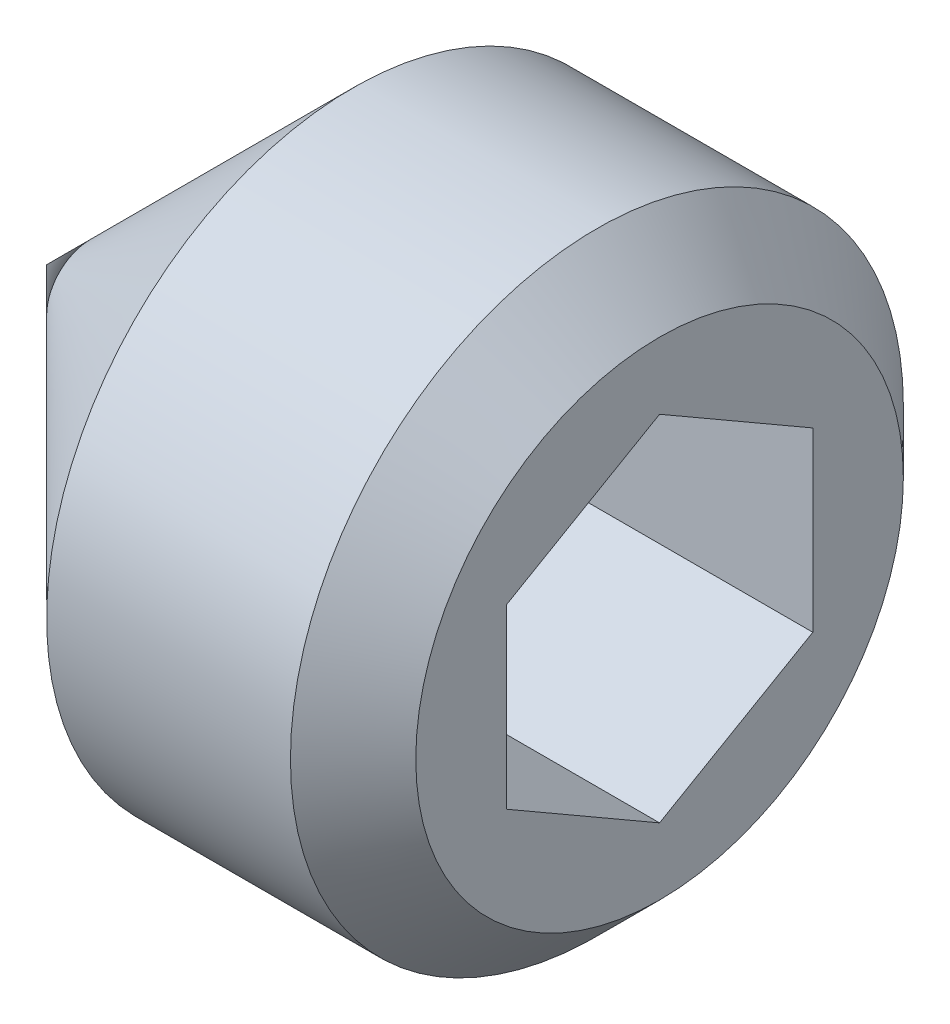
ISO-10303-21;
HEADER;
FILE_DESCRIPTION(('STEP AP214'),'2;1');
FILE_NAME('part.step','',(''),(''),'','','');
FILE_SCHEMA(('AUTOMOTIVE_DESIGN { 1 0 10303 214 1 1 1 1 }'));
ENDSEC;
DATA;
#1=APPLICATION_CONTEXT('core data for automotive mechanical design processes');
#2=APPLICATION_PROTOCOL_DEFINITION('international standard','automotive_design',2000,#1);
#3=PRODUCT_CONTEXT('',#1,'mechanical');
#4=PRODUCT('Part','Part','',(#3));
#5=PRODUCT_RELATED_PRODUCT_CATEGORY('part','',(#4));
#6=PRODUCT_DEFINITION_FORMATION('','',#4);
#7=PRODUCT_DEFINITION_CONTEXT('part definition',#1,'design');
#8=PRODUCT_DEFINITION('design','',#6,#7);
#9=PRODUCT_DEFINITION_SHAPE('','',#8);
#10=(LENGTH_UNIT() NAMED_UNIT(*) SI_UNIT(.MILLI.,.METRE.));
#11=(NAMED_UNIT(*) PLANE_ANGLE_UNIT() SI_UNIT($,.RADIAN.));
#12=(NAMED_UNIT(*) SI_UNIT($,.STERADIAN.) SOLID_ANGLE_UNIT());
#13=UNCERTAINTY_MEASURE_WITH_UNIT(LENGTH_MEASURE(1.E-05),#10,'distance_accuracy_value','');
#14=(GEOMETRIC_REPRESENTATION_CONTEXT(3) GLOBAL_UNCERTAINTY_ASSIGNED_CONTEXT((#13)) GLOBAL_UNIT_ASSIGNED_CONTEXT((#10,
#11,#12)) REPRESENTATION_CONTEXT('',''));
#15=CARTESIAN_POINT('',(0.,0.,0.));
#16=DIRECTION('',(0.,0.,1.));
#17=DIRECTION('',(1.,0.,0.));
#18=AXIS2_PLACEMENT_3D('',#15,#16,#17);
#19=CARTESIAN_POINT('',(3.,-0.433012701892213,-0.749999999999996));
#20=DIRECTION('',(0.,0.,-1.));
#21=DIRECTION('',(0.,1.,0.));
#22=AXIS2_PLACEMENT_3D('',#19,#20,#21);
#23=PLANE('',#22);
#24=DIRECTION('',(1.,0.,0.));
#25=VECTOR('',#24,1.);
#26=CARTESIAN_POINT('',(3.,-0.433012701892213,-0.749999999999996));
#27=LINE('',#26,#25);
#28=CARTESIAN_POINT('',(0.999999999962121,-0.433012701894947,-0.750000000004731));
#29=VERTEX_POINT('',#28);
#30=CARTESIAN_POINT('',(3.,-0.433012701892213,-0.749999999999996));
#31=VERTEX_POINT('',#30);
#32=EDGE_CURVE('E78',#29,#31,#27,.T.);
#33=ORIENTED_EDGE('',*,*,#32,.T.);
#34=DIRECTION('',(0.,1.,0.));
#35=VECTOR('',#34,1.);
#36=CARTESIAN_POINT('',(3.,-0.433012701892213,-0.749999999999996));
#37=LINE('',#36,#35);
#38=CARTESIAN_POINT('',(3.,0.433012701892219,-0.749999999999994));
#39=VERTEX_POINT('',#38);
#40=EDGE_CURVE('E84',#39,#31,#37,.F.);
#41=ORIENTED_EDGE('',*,*,#40,.F.);
#42=DIRECTION('',(1.,0.,0.));
#43=VECTOR('',#42,1.);
#44=CARTESIAN_POINT('',(3.,0.433012701892219,-0.749999999999994));
#45=LINE('',#44,#43);
#46=CARTESIAN_POINT('',(0.999999999960543,0.433012701897685,-0.749999999999994));
#47=VERTEX_POINT('',#46);
#48=EDGE_CURVE('E81',#39,#47,#45,.F.);
#49=ORIENTED_EDGE('',*,*,#48,.T.);
#50=CARTESIAN_POINT('',(0.999999999962121,-0.433012701903148,-0.749999999999996));
#51=CARTESIAN_POINT('',(0.989010828242881,-0.39495613049456,-0.749999999999996));
#52=CARTESIAN_POINT('',(0.979016752629088,-0.356571055078982,-0.749999999999996));
#53=CARTESIAN_POINT('',(0.961572394458081,-0.279136292191111,-0.749999999999996));
#54=CARTESIAN_POINT('',(0.954128282381848,-0.24008522930043,-0.749999999999996));
#55=CARTESIAN_POINT('',(0.942540984766453,-0.162467043921834,-0.749999999999995));
#56=CARTESIAN_POINT('',(0.938320670362053,-0.123911860637817,-0.749999999999995));
#57=CARTESIAN_POINT('',(0.933283437953925,-0.0466201738043249,-0.749999999999995));
#58=CARTESIAN_POINT('',(0.932462347685355,-0.0078839509963972,-0.749999999999995));
#59=CARTESIAN_POINT('',(0.934174858777906,0.0644905257899308,-0.749999999999995));
#60=CARTESIAN_POINT('',(0.936287981917351,0.0981396401494632,-0.749999999999995));
#61=CARTESIAN_POINT('',(0.942983987724431,0.16521865586672,-0.749999999999994));
#62=CARTESIAN_POINT('',(0.947569155495857,0.198648325389211,-0.749999999999994));
#63=CARTESIAN_POINT('',(0.959031187462022,0.265865530206527,-0.749999999999994));
#64=CARTESIAN_POINT('',(0.965956615792015,0.299644562548561,-0.749999999999994));
#65=CARTESIAN_POINT('',(0.981674410275084,0.366698958680412,-0.749999999999994));
#66=CARTESIAN_POINT('',(0.990463085742577,0.399975180851877,-0.749999999999994));
#67=CARTESIAN_POINT('',(0.999999999962121,0.433012701903152,-0.749999999999994));
#68=B_SPLINE_CURVE_WITH_KNOTS('',3,(#50,#51,#52,#53,#54,#55,#56,#57,#58,#59,#60,#61,#62,#63,#64,
#65,#66,#67),.UNSPECIFIED.,.F.,.F.,(4,2,2,2,2,2,2,2,4),(0.,0.118881004366687,0.238047681455816,
0.354265352378773,0.470340333408877,0.571390418563902,0.672534072754611,0.77592060852001,
0.879104240159883),.UNSPECIFIED.);
#69=EDGE_CURVE('E21',#29,#47,#68,.T.);
#70=ORIENTED_EDGE('',*,*,#69,.F.);
#71=EDGE_LOOP('',(#33,#41,#49,#70));
#72=FACE_BOUND('',#71,.T.);
#73=ADVANCED_FACE('F17',(#72),#23,.F.);
#74=CARTESIAN_POINT('',(3.,-0.866025403784432,0.));
#75=DIRECTION('',(0.,-0.866025403784437,-0.500000000000003));
#76=DIRECTION('',(0.,0.500000000000003,-0.866025403784437));
#77=AXIS2_PLACEMENT_3D('',#74,#75,#76);
#78=PLANE('',#77);
#79=DIRECTION('',(1.,0.,0.));
#80=VECTOR('',#79,1.);
#81=CARTESIAN_POINT('',(3.,-0.866025403784432,0.));
#82=LINE('',#81,#80);
#83=CARTESIAN_POINT('',(0.999999999960689,-0.86602540378742,5.17137737454117E-12));
#84=VERTEX_POINT('',#83);
#85=CARTESIAN_POINT('',(3.,-0.866025403784432,0.));
#86=VERTEX_POINT('',#85);
#87=EDGE_CURVE('E152',#84,#86,#82,.T.);
#88=ORIENTED_EDGE('',*,*,#87,.T.);
#89=DIRECTION('',(0.,0.500000000000003,-0.866025403784437));
#90=VECTOR('',#89,1.);
#91=CARTESIAN_POINT('',(3.,-0.866025403784432,0.));
#92=LINE('',#91,#90);
#93=EDGE_CURVE('E94',#31,#86,#92,.F.);
#94=ORIENTED_EDGE('',*,*,#93,.F.);
#95=ORIENTED_EDGE('',*,*,#32,.F.);
#96=CARTESIAN_POINT('',(0.999999999962414,-0.866025403790407,1.03461158247932E-11));
#97=CARTESIAN_POINT('',(0.98901082824315,-0.846997118086104,-0.0329579576104424));
#98=CARTESIAN_POINT('',(0.979016752629332,-0.827804580378307,-0.066200408046529));
#99=CARTESIAN_POINT('',(0.961572394458272,-0.789087198934353,-0.13326087984348));
#100=CARTESIAN_POINT('',(0.954128282382011,-0.769561667489004,-0.167080092351609));
#101=CARTESIAN_POINT('',(0.942540984766562,-0.730752574799687,-0.234299412685156));
#102=CARTESIAN_POINT('',(0.938320670362134,-0.711474983157669,-0.267689180856696));
#103=CARTESIAN_POINT('',(0.933283437953954,-0.672829139740903,-0.334625745155884));
#104=CARTESIAN_POINT('',(0.932462347685359,-0.653461028336929,-0.368172298154222));
#105=CARTESIAN_POINT('',(0.934174858777868,-0.617273789943722,-0.430850433636863));
#106=CARTESIAN_POINT('',(0.936287981917299,-0.600449232763923,-0.459991421487123));
#107=CARTESIAN_POINT('',(0.942983987724363,-0.566909724905229,-0.518083553159236));
#108=CARTESIAN_POINT('',(0.947569155495786,-0.55019489014395,-0.547034496205888));
#109=CARTESIAN_POINT('',(0.959031187461956,-0.516586287735225,-0.605246303149181));
#110=CARTESIAN_POINT('',(0.965956615791957,-0.499696771564174,-0.634499803272697));
#111=CARTESIAN_POINT('',(0.981674410275049,-0.466169573498182,-0.692570613758421));
#112=CARTESIAN_POINT('',(0.990463085742558,-0.449531462412416,-0.721388667500942));
#113=CARTESIAN_POINT('',(0.999999999962121,-0.433012701886746,-0.750000000009465));
#114=B_SPLINE_CURVE_WITH_KNOTS('',3,(#96,#97,#98,#99,#100,#101,#102,#103,#104,#105,#106,#107,
#108,#109,#110,#111,#112,#113),.UNSPECIFIED.,.F.,.F.,(4,2,2,2,2,2,2,2,4),(0.,0.118881004366756,
0.238047681455955,0.354265352378976,0.470340333409143,0.57139041856436,0.672534072755263,
0.775920608520866,0.87910424016094),.UNSPECIFIED.);
#115=EDGE_CURVE('E86',#84,#29,#114,.T.);
#116=ORIENTED_EDGE('',*,*,#115,.F.);
#117=EDGE_LOOP('',(#88,#94,#95,#116));
#118=FACE_BOUND('',#117,.T.);
#119=ADVANCED_FACE('F95',(#118),#78,.F.);
#120=CARTESIAN_POINT('',(3.,0.433012701892219,-0.749999999999994));
#121=DIRECTION('',(0.,0.86602540378444,-0.499999999999998));
#122=DIRECTION('',(0.,0.499999999999998,0.86602540378444));
#123=AXIS2_PLACEMENT_3D('',#120,#121,#122);
#124=PLANE('',#123);
#125=ORIENTED_EDGE('',*,*,#48,.F.);
#126=DIRECTION('',(0.,0.499999999999998,0.86602540378444));
#127=VECTOR('',#126,1.);
#128=CARTESIAN_POINT('',(3.,0.433012701892219,-0.749999999999994));
#129=LINE('',#128,#127);
#130=CARTESIAN_POINT('',(3.,0.866025403784434,0.));
#131=VERTEX_POINT('',#130);
#132=EDGE_CURVE('E93',#131,#39,#129,.F.);
#133=ORIENTED_EDGE('',*,*,#132,.F.);
#134=DIRECTION('',(1.,0.,0.));
#135=VECTOR('',#134,1.);
#136=CARTESIAN_POINT('',(3.,0.866025403784435,0.));
#137=LINE('',#136,#135);
#138=CARTESIAN_POINT('',(1.00000000476924,0.866025412116072,1.44308221374837E-08));
#139=VERTEX_POINT('',#138);
#140=EDGE_CURVE('E197',#131,#139,#137,.F.);
#141=ORIENTED_EDGE('',*,*,#140,.T.);
#142=CARTESIAN_POINT('',(0.999999999962122,0.433012701886752,-0.750000000009464));
#143=CARTESIAN_POINT('',(0.989010828239795,0.452040987596458,-0.717042042379314));
#144=CARTESIAN_POINT('',(0.979016752623435,0.471233525309727,-0.683799591933751));
#145=CARTESIAN_POINT('',(0.961572394448595,0.50995090676548,-0.616739120116361));
#146=CARTESIAN_POINT('',(0.954128282371191,0.529476438217169,-0.582919907597253));
#147=CARTESIAN_POINT('',(0.942540984759421,0.568285530907423,-0.515700587262082));
#148=CARTESIAN_POINT('',(0.938320670357912,0.587563122543893,-0.482310819100152));
#149=CARTESIAN_POINT('',(0.933283437953257,0.626208965948556,-0.415374254821923));
#150=CARTESIAN_POINT('',(0.93246234768518,0.645577077345975,-0.38182770183494));
#151=CARTESIAN_POINT('',(0.934174858844876,0.681764317140096,-0.319149563925843));
#152=CARTESIAN_POINT('',(0.936287982271723,0.698588875724347,-0.290008573643002));
#153=CARTESIAN_POINT('',(0.942983989049004,0.732128386368607,-0.231916437146147));
#154=CARTESIAN_POINT('',(0.947569157504165,0.748843222510944,-0.20296549170743));
#155=CARTESIAN_POINT('',(0.959031191175185,0.782451827713753,-0.14475367992464));
#156=CARTESIAN_POINT('',(0.965956620538646,0.799341345296458,-0.115500177356067));
#157=CARTESIAN_POINT('',(0.981674417313412,0.832868546134397,-0.0574293620691909));
#158=CARTESIAN_POINT('',(0.990463094037767,0.84950665858064,-0.0286113059702538));
#159=CARTESIAN_POINT('',(1.00000000957951,0.86602542044771,2.8861642659226E-08));
#160=B_SPLINE_CURVE_WITH_KNOTS('',3,(#142,#143,#144,#145,#146,#147,#148,#149,#150,#151,#152,
#153,#154,#155,#156,#157,#158,#159),.UNSPECIFIED.,.F.,.F.,(4,2,2,2,2,2,2,2,4),(0.,
0.118881004400395,0.23804768152756,0.354265352416226,0.470340333408895,0.571390427002778,
0.672534089663568,0.775920634338892,0.87910427482085),.UNSPECIFIED.);
#161=EDGE_CURVE('E147',#47,#139,#160,.T.);
#162=ORIENTED_EDGE('',*,*,#161,.F.);
#163=EDGE_LOOP('',(#125,#133,#141,#162));
#164=FACE_BOUND('',#163,.T.);
#165=ADVANCED_FACE('F153',(#164),#124,.F.);
#166=CARTESIAN_POINT('',(3.,-0.433012701892217,0.749999999999994));
#167=DIRECTION('',(0.,-0.86602540378444,0.499999999999998));
#168=DIRECTION('',(0.,-0.499999999999998,-0.86602540378444));
#169=AXIS2_PLACEMENT_3D('',#166,#167,#168);
#170=PLANE('',#169);
#171=DIRECTION('',(1.,0.,0.));
#172=VECTOR('',#171,1.);
#173=CARTESIAN_POINT('',(3.,-0.433012701892217,0.749999999999994));
#174=LINE('',#173,#172);
#175=CARTESIAN_POINT('',(0.999999992273757,-0.433012740197771,0.749999962513854));
#176=VERTEX_POINT('',#175);
#177=CARTESIAN_POINT('',(3.,-0.433012701892217,0.749999999999995));
#178=VERTEX_POINT('',#177);
#179=EDGE_CURVE('E227',#176,#178,#174,.T.);
#180=ORIENTED_EDGE('',*,*,#179,.T.);
#181=DIRECTION('',(0.,-0.499999999999998,-0.86602540378444));
#182=VECTOR('',#181,1.);
#183=CARTESIAN_POINT('',(3.,-0.433012701892217,0.749999999999994));
#184=LINE('',#183,#182);
#185=EDGE_CURVE('E198',#86,#178,#184,.F.);
#186=ORIENTED_EDGE('',*,*,#185,.F.);
#187=ORIENTED_EDGE('',*,*,#87,.F.);
#188=CARTESIAN_POINT('',(0.999999999966565,-0.86602540378386,-1.27486163788E-11));
#189=CARTESIAN_POINT('',(0.989010828252531,-0.84699711809759,0.0329579575856099));
#190=CARTESIAN_POINT('',(0.979016752644196,-0.827804580405544,0.0662004079980264));
#191=CARTESIAN_POINT('',(0.961572394482182,-0.789087198993177,0.133260879742916));
#192=CARTESIAN_POINT('',(0.954128282409237,-0.769561667563686,0.167080092222603));
#193=CARTESIAN_POINT('',(0.94254098478461,-0.730752574876204,0.23429941255228));
#194=CARTESIAN_POINT('',(0.938320670372638,-0.711474983219766,0.267689180749048));
#195=CARTESIAN_POINT('',(0.933283437955526,-0.672829139771393,0.334625745103164));
#196=CARTESIAN_POINT('',(0.932462347685778,-0.653461028350226,0.368172298131213));
#197=CARTESIAN_POINT('',(0.934174858604027,-0.617273793597875,0.430850427307664));
#198=CARTESIAN_POINT('',(0.936287980996616,-0.600449240068274,0.45999140883561));
#199=CARTESIAN_POINT('',(0.942983984282372,-0.566909739449323,0.518083527968133));
#200=CARTESIAN_POINT('',(0.947569150276894,-0.550194908277445,0.547034464797758));
#201=CARTESIAN_POINT('',(0.959031177812411,-0.516586313130587,0.605246259163125));
#202=CARTESIAN_POINT('',(0.965956603456569,-0.499696800628438,0.634499752931918));
#203=CARTESIAN_POINT('',(0.981674391983821,-0.466169609766752,0.692570550939419));
#204=CARTESIAN_POINT('',(0.990463064184889,-0.449531502216874,0.721388598557605));
#205=CARTESIAN_POINT('',(0.999999974968193,-0.433012745177506,0.749999925027674));
#206=B_SPLINE_CURVE_WITH_KNOTS('',3,(#188,#189,#190,#191,#192,#193,#194,#195,#196,#197,#198,
#199,#200,#201,#202,#203,#204,#205),.UNSPECIFIED.,.F.,.F.,(4,2,2,2,2,2,2,2,4),(0.,
0.118881004280357,0.238047681271773,0.354265352284752,0.470340333413098,0.571390396636129,
0.67253402881367,0.775920541422912,0.879104150082983),.UNSPECIFIED.);
#207=EDGE_CURVE('E89',#84,#176,#206,.T.);
#208=ORIENTED_EDGE('',*,*,#207,.T.);
#209=EDGE_LOOP('',(#180,#186,#187,#208));
#210=FACE_BOUND('',#209,.T.);
#211=ADVANCED_FACE('F156',(#210),#170,.F.);
#212=CARTESIAN_POINT('',(3.,0.866025403784434,0.));
#213=DIRECTION('',(0.,0.866025403784438,0.500000000000002));
#214=DIRECTION('',(0.,-0.500000000000002,0.866025403784438));
#215=AXIS2_PLACEMENT_3D('',#212,#213,#214);
#216=PLANE('',#215);
#217=ORIENTED_EDGE('',*,*,#140,.F.);
#218=DIRECTION('',(0.,-0.500000000000002,0.866025403784438));
#219=VECTOR('',#218,1.);
#220=CARTESIAN_POINT('',(3.,0.866025403784434,0.));
#221=LINE('',#220,#219);
#222=CARTESIAN_POINT('',(3.,0.433012701892216,0.749999999999996));
#223=VERTEX_POINT('',#222);
#224=EDGE_CURVE('E188',#223,#131,#221,.F.);
#225=ORIENTED_EDGE('',*,*,#224,.F.);
#226=DIRECTION('',(1.,0.,0.));
#227=VECTOR('',#226,1.);
#228=CARTESIAN_POINT('',(3.,0.433012701892216,0.749999999999996));
#229=LINE('',#228,#227);
#230=CARTESIAN_POINT('',(0.999999987456827,0.433012723546556,0.749999962493579));
#231=VERTEX_POINT('',#230);
#232=EDGE_CURVE('E119',#223,#231,#229,.F.);
#233=ORIENTED_EDGE('',*,*,#232,.T.);
#234=CARTESIAN_POINT('',(0.999999974954689,0.433012745200896,0.749999924987162));
#235=CARTESIAN_POINT('',(0.989010805289448,0.452041030174259,0.717041968632398));
#236=CARTESIAN_POINT('',(0.979016731857365,0.471233567146418,0.683799519470476));
#237=CARTESIAN_POINT('',(0.961572378214463,0.509950947046766,0.616739050347126));
#238=CARTESIAN_POINT('',(0.954128268481779,0.529476477683681,0.582919839239246));
#239=CARTESIAN_POINT('',(0.942540975499378,0.568285568788077,0.515700521650865));
#240=CARTESIAN_POINT('',(0.938320663398557,0.587563159656827,0.482310754818663));
#241=CARTESIAN_POINT('',(0.933283435442763,0.626209001437502,0.415374193353267));
#242=CARTESIAN_POINT('',(0.932462347324832,0.645577111978832,0.381827641849072));
#243=CARTESIAN_POINT('',(0.934174861815945,0.681764343053098,0.319149519043209));
#244=CARTESIAN_POINT('',(0.936287985371578,0.698588893799179,0.290008542336477));
#245=CARTESIAN_POINT('',(0.942983990052212,0.732128388842047,0.231916432862024));
#246=CARTESIAN_POINT('',(0.947569156276532,0.748843217221423,0.202965500869151));
#247=CARTESIAN_POINT('',(0.959031183412921,0.782451806683928,0.144753716349369));
#248=CARTESIAN_POINT('',(0.965956608398113,0.799341316296327,0.115500227585771));
#249=CARTESIAN_POINT('',(0.981674394920445,0.832868501467518,0.0574294394344978));
#250=CARTESIAN_POINT('',(0.990463065778315,0.849506606216351,0.0286113966678668));
#251=CARTESIAN_POINT('',(0.999999974967999,0.866025360498807,7.49729072637118E-08));
#252=B_SPLINE_CURVE_WITH_KNOTS('',3,(#234,#235,#236,#237,#238,#239,#240,#241,#242,#243,#244,
#245,#246,#247,#248,#249,#250,#251),.UNSPECIFIED.,.F.,.F.,(4,2,2,2,2,2,2,2,4),(0.,
0.118880998435461,0.238047669430943,0.354265334989351,0.470340310719626,0.5713903575498,
0.672533973271227,0.775920468532192,0.879104059954767),.UNSPECIFIED.);
#253=EDGE_CURVE('E143',#231,#139,#252,.T.);
#254=ORIENTED_EDGE('',*,*,#253,.T.);
#255=EDGE_LOOP('',(#217,#225,#233,#254));
#256=FACE_BOUND('',#255,.T.);
#257=ADVANCED_FACE('F131',(#256),#216,.F.);
#258=CARTESIAN_POINT('',(1.00299999996878,0.,0.));
#259=DIRECTION('',(1.,0.,0.));
#260=DIRECTION('',(0.,0.,-1.));
#261=AXIS2_PLACEMENT_3D('',#258,#259,#260);
#262=CONICAL_SURFACE('',#261,0.8712215562241,1.04719755119347);
#263=CARTESIAN_POINT('',(0.499999999988177,-5.6843418860808E-11,0.));
#264=VERTEX_POINT('',#263);
#265=VERTEX_LOOP('',#264);
#266=FACE_BOUND('',#265,.T.);
#267=ORIENTED_EDGE('',*,*,#207,.F.);
#268=ORIENTED_EDGE('',*,*,#115,.T.);
#269=ORIENTED_EDGE('',*,*,#69,.T.);
#270=ORIENTED_EDGE('',*,*,#161,.T.);
#271=ORIENTED_EDGE('',*,*,#253,.F.);
#272=CARTESIAN_POINT('',(1.00000000957721,0.433012735210792,0.749999999999996));
#273=CARTESIAN_POINT('',(0.989010837068228,0.394956163240126,0.749999999999996));
#274=CARTESIAN_POINT('',(0.979016760615589,0.356571087258855,0.749999999999996));
#275=CARTESIAN_POINT('',(0.961572400703571,0.279136323183982,0.749999999999996));
#276=CARTESIAN_POINT('',(0.954128287726268,0.24008525967163,0.749999999999996));
#277=CARTESIAN_POINT('',(0.94254098832954,0.162467073074276,0.749999999999995));
#278=CARTESIAN_POINT('',(0.93832067303944,0.123911889195648,0.749999999999995));
#279=CARTESIAN_POINT('',(0.93328343891944,0.0466202011040706,0.749999999999995));
#280=CARTESIAN_POINT('',(0.932462347823974,0.00788397763280637,0.749999999999995));
#281=CARTESIAN_POINT('',(0.934174857609864,-0.0644905047836985,0.749999999999995));
#282=CARTESIAN_POINT('',(0.936287980589504,-0.0981396240927032,0.749999999999995));
#283=CARTESIAN_POINT('',(0.942983986830419,-0.165218649669182,0.749999999999994));
#284=CARTESIAN_POINT('',(0.947569155197203,-0.198648324101265,0.749999999999994));
#285=CARTESIAN_POINT('',(0.959031189021643,-0.265865538878085,0.749999999999994));
#286=CARTESIAN_POINT('',(0.965956618638452,-0.299644576265673,0.749999999999994));
#287=CARTESIAN_POINT('',(0.981674416184057,-0.366698982317455,0.749999999999994));
#288=CARTESIAN_POINT('',(0.990463093424844,-0.3999752093639,0.749999999999994));
#289=CARTESIAN_POINT('',(1.00000000957931,-0.43301273521806,0.749999999999994));
#290=B_SPLINE_CURVE_WITH_KNOTS('',3,(#272,#273,#274,#275,#276,#277,#278,#279,#280,#281,#282,
#283,#284,#285,#286,#287,#288,#289),.UNSPECIFIED.,.F.,.F.,(4,2,2,2,2,2,2,2,4),(0.,
0.118881006647205,0.238047686079304,0.354265359064848,0.47034034213265,0.571390442029497,
0.672534111017583,0.775920662363185,0.879104309472806),.UNSPECIFIED.);
#291=EDGE_CURVE('E113',#231,#176,#290,.T.);
#292=ORIENTED_EDGE('',*,*,#291,.T.);
#293=EDGE_LOOP('',(#267,#268,#269,#270,#271,#292));
#294=FACE_BOUND('',#293,.T.);
#295=ADVANCED_FACE('F87',(#266,#294),#262,.F.);
#296=CARTESIAN_POINT('',(3.,0.433012701892216,0.749999999999996));
#297=DIRECTION('',(0.,0.,1.));
#298=DIRECTION('',(0.,-1.,0.));
#299=AXIS2_PLACEMENT_3D('',#296,#297,#298);
#300=PLANE('',#299);
#301=ORIENTED_EDGE('',*,*,#232,.F.);
#302=DIRECTION('',(0.,1.,0.));
#303=VECTOR('',#302,1.);
#304=CARTESIAN_POINT('',(3.,0.,0.749999999999996));
#305=LINE('',#304,#303);
#306=EDGE_CURVE('E112',#223,#178,#305,.F.);
#307=ORIENTED_EDGE('',*,*,#306,.T.);
#308=ORIENTED_EDGE('',*,*,#179,.F.);
#309=ORIENTED_EDGE('',*,*,#291,.F.);
#310=EDGE_LOOP('',(#301,#307,#308,#309));
#311=FACE_BOUND('',#310,.T.);
#312=ADVANCED_FACE('F125',(#311),#300,.F.);
#313=CARTESIAN_POINT('',(3.,0.,0.));
#314=DIRECTION('',(-1.,0.,0.));
#315=DIRECTION('',(0.,0.,1.));
#316=AXIS2_PLACEMENT_3D('',#313,#314,#315);
#317=PLANE('',#316);
#318=ORIENTED_EDGE('',*,*,#224,.T.);
#319=ORIENTED_EDGE('',*,*,#132,.T.);
#320=ORIENTED_EDGE('',*,*,#40,.T.);
#321=ORIENTED_EDGE('',*,*,#93,.T.);
#322=ORIENTED_EDGE('',*,*,#185,.T.);
#323=ORIENTED_EDGE('',*,*,#306,.F.);
#324=EDGE_LOOP('',(#318,#319,#320,#321,#322,#323));
#325=FACE_BOUND('',#324,.T.);
#326=CARTESIAN_POINT('',(2.9999999999859,0.,0.));
#327=DIRECTION('',(-1.,0.,0.));
#328=DIRECTION('',(0.,0.,1.));
#329=AXIS2_PLACEMENT_3D('',#326,#327,#328);
#330=CIRCLE('',#329,1.19327500004829);
#331=CARTESIAN_POINT('',(2.9999999999859,0.,1.19327500004829));
#332=VERTEX_POINT('',#331);
#333=EDGE_CURVE('E109',#332,#332,#330,.T.);
#334=ORIENTED_EDGE('',*,*,#333,.F.);
#335=EDGE_LOOP('',(#334));
#336=FACE_BOUND('',#335,.T.);
#337=ADVANCED_FACE('F179',(#325,#336),#317,.F.);
#338=CARTESIAN_POINT('',(1.49999500001741,0.,0.));
#339=DIRECTION('',(1.,0.,0.));
#340=DIRECTION('',(0.,0.,-1.));
#341=AXIS2_PLACEMENT_3D('',#338,#339,#340);
#342=CONICAL_SURFACE('',#341,1.50000000002137,0.785399830049267);
#343=CARTESIAN_POINT('',(0.,5.6843418860808E-11,0.));
#344=VERTEX_POINT('',#343);
#345=VERTEX_LOOP('',#344);
#346=FACE_BOUND('',#345,.T.);
#347=CARTESIAN_POINT('',(1.499995,0.,0.));
#348=DIRECTION('',(1.,0.,0.));
#349=DIRECTION('',(0.,0.,-1.));
#350=AXIS2_PLACEMENT_3D('',#347,#348,#349);
#351=CIRCLE('',#350,1.5);
#352=CARTESIAN_POINT('',(1.499995,0.,-1.5));
#353=VERTEX_POINT('',#352);
#354=EDGE_CURVE('E31',#353,#353,#351,.T.);
#355=ORIENTED_EDGE('',*,*,#354,.F.);
#356=EDGE_LOOP('',(#355));
#357=FACE_BOUND('',#356,.T.);
#358=ADVANCED_FACE('F173',(#346,#357),#342,.T.);
#359=CARTESIAN_POINT('',(2.69327500001282,0.,0.));
#360=DIRECTION('',(-1.,0.,0.));
#361=DIRECTION('',(0.,0.,1.));
#362=AXIS2_PLACEMENT_3D('',#359,#360,#361);
#363=CONICAL_SURFACE('',#362,1.50000000002137,0.785398163397448);
#364=ORIENTED_EDGE('',*,*,#333,.T.);
#365=EDGE_LOOP('',(#364));
#366=FACE_BOUND('',#365,.T.);
#367=CARTESIAN_POINT('',(2.693275,0.,0.));
#368=DIRECTION('',(1.,0.,0.));
#369=DIRECTION('',(0.,0.,-1.));
#370=AXIS2_PLACEMENT_3D('',#367,#368,#369);
#371=CIRCLE('',#370,1.5);
#372=CARTESIAN_POINT('',(2.693275,0.,-1.5));
#373=VERTEX_POINT('',#372);
#374=EDGE_CURVE('E11',#373,#373,#371,.F.);
#375=ORIENTED_EDGE('',*,*,#374,.F.);
#376=EDGE_LOOP('',(#375));
#377=FACE_BOUND('',#376,.T.);
#378=ADVANCED_FACE('F167',(#366,#377),#363,.T.);
#379=CARTESIAN_POINT('',(1.5,0.,0.));
#380=DIRECTION('',(1.,0.,0.));
#381=DIRECTION('',(0.,0.,-1.));
#382=AXIS2_PLACEMENT_3D('',#379,#380,#381);
#383=CYLINDRICAL_SURFACE('',#382,1.5);
#384=ORIENTED_EDGE('',*,*,#374,.T.);
#385=EDGE_LOOP('',(#384));
#386=FACE_BOUND('',#385,.T.);
#387=ORIENTED_EDGE('',*,*,#354,.T.);
#388=EDGE_LOOP('',(#387));
#389=FACE_BOUND('',#388,.T.);
#390=ADVANCED_FACE('F165',(#386,#389),#383,.T.);
#391=CLOSED_SHELL('',(#73,#119,#165,#211,#257,#295,#312,#337,#358,#378,#390));
#392=MANIFOLD_SOLID_BREP('B1',#391);
#393=ADVANCED_BREP_SHAPE_REPRESENTATION('',(#18,#392),#14);
#394=SHAPE_DEFINITION_REPRESENTATION(#9,#393);
ENDSEC;
END-ISO-10303-21;
